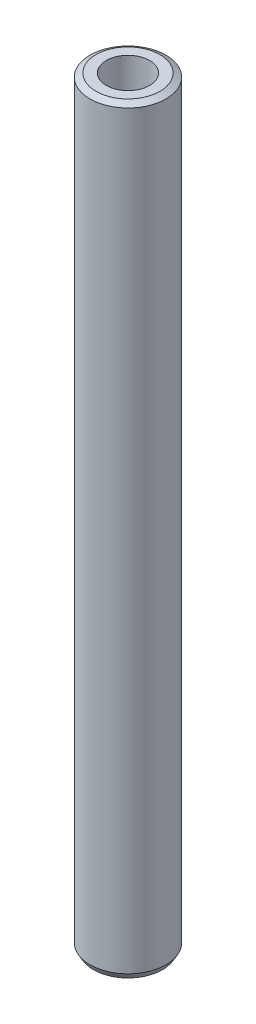
ISO-10303-21;
HEADER;
FILE_DESCRIPTION(('STEP AP214'),'2;1');
FILE_NAME('part.step','',(''),(''),'','','');
FILE_SCHEMA(('AUTOMOTIVE_DESIGN { 1 0 10303 214 1 1 1 1 }'));
ENDSEC;
DATA;
#1=APPLICATION_CONTEXT('core data for automotive mechanical design processes');
#2=APPLICATION_PROTOCOL_DEFINITION('international standard','automotive_design',2000,#1);
#3=PRODUCT_CONTEXT('',#1,'mechanical');
#4=PRODUCT('Part','Part','',(#3));
#5=PRODUCT_RELATED_PRODUCT_CATEGORY('part','',(#4));
#6=PRODUCT_DEFINITION_FORMATION('','',#4);
#7=PRODUCT_DEFINITION_CONTEXT('part definition',#1,'design');
#8=PRODUCT_DEFINITION('design','',#6,#7);
#9=PRODUCT_DEFINITION_SHAPE('','',#8);
#10=(LENGTH_UNIT() NAMED_UNIT(*) SI_UNIT(.MILLI.,.METRE.));
#11=(NAMED_UNIT(*) PLANE_ANGLE_UNIT() SI_UNIT($,.RADIAN.));
#12=(NAMED_UNIT(*) SI_UNIT($,.STERADIAN.) SOLID_ANGLE_UNIT());
#13=UNCERTAINTY_MEASURE_WITH_UNIT(LENGTH_MEASURE(1.E-05),#10,'distance_accuracy_value','');
#14=(GEOMETRIC_REPRESENTATION_CONTEXT(3) GLOBAL_UNCERTAINTY_ASSIGNED_CONTEXT((#13)) GLOBAL_UNIT_ASSIGNED_CONTEXT((#10,
#11,#12)) REPRESENTATION_CONTEXT('',''));
#15=CARTESIAN_POINT('',(0.,0.,0.));
#16=DIRECTION('',(0.,0.,1.));
#17=DIRECTION('',(1.,0.,0.));
#18=AXIS2_PLACEMENT_3D('',#15,#16,#17);
#19=CARTESIAN_POINT('',(0.,399.763591332747,0.));
#20=DIRECTION('',(0.,-1.,0.));
#21=DIRECTION('',(0.,0.,-1.));
#22=AXIS2_PLACEMENT_3D('',#19,#20,#21);
#23=CYLINDRICAL_SURFACE('',#22,20.);
#24=CARTESIAN_POINT('',(0.,397.913172267002,0.));
#25=DIRECTION('',(0.,1.,0.));
#26=DIRECTION('',(0.,0.,1.));
#27=AXIS2_PLACEMENT_3D('',#24,#25,#26);
#28=CIRCLE('',#27,20.);
#29=CARTESIAN_POINT('',(0.,397.913172267002,20.));
#30=VERTEX_POINT('',#29);
#31=EDGE_CURVE('E50',#30,#30,#28,.F.);
#32=ORIENTED_EDGE('',*,*,#31,.T.);
#33=EDGE_LOOP('',(#32));
#34=FACE_BOUND('',#33,.T.);
#35=CARTESIAN_POINT('',(0.,3.20501983716426,0.));
#36=DIRECTION('',(0.,1.,0.));
#37=DIRECTION('',(0.,0.,1.));
#38=AXIS2_PLACEMENT_3D('',#35,#36,#37);
#39=CIRCLE('',#38,20.);
#40=CARTESIAN_POINT('',(0.,3.20501983716426,20.));
#41=VERTEX_POINT('',#40);
#42=EDGE_CURVE('E51',#41,#41,#39,.T.);
#43=ORIENTED_EDGE('',*,*,#42,.T.);
#44=EDGE_LOOP('',(#43));
#45=FACE_BOUND('',#44,.T.);
#46=ADVANCED_FACE('F39',(#34,#45),#23,.T.);
#47=CARTESIAN_POINT('',(0.,399.763591332747,0.));
#48=DIRECTION('',(0.,1.,0.));
#49=DIRECTION('',(0.,0.,1.));
#50=AXIS2_PLACEMENT_3D('',#47,#48,#49);
#51=PLANE('',#50);
#52=CARTESIAN_POINT('',(0.,399.763591332747,0.));
#53=DIRECTION('',(0.,1.,0.));
#54=DIRECTION('',(0.,0.,1.));
#55=AXIS2_PLACEMENT_3D('',#52,#53,#54);
#56=CIRCLE('',#55,16.7949801628356);
#57=CARTESIAN_POINT('',(0.,399.763591332747,16.7949801628356));
#58=VERTEX_POINT('',#57);
#59=EDGE_CURVE('E54',#58,#58,#56,.T.);
#60=ORIENTED_EDGE('',*,*,#59,.T.);
#61=EDGE_LOOP('',(#60));
#62=FACE_BOUND('',#61,.T.);
#63=CARTESIAN_POINT('',(0.,399.763591332747,0.));
#64=DIRECTION('',(0.,1.,0.));
#65=DIRECTION('',(0.,0.,1.));
#66=AXIS2_PLACEMENT_3D('',#63,#64,#65);
#67=CIRCLE('',#66,11.4137695171545);
#68=CARTESIAN_POINT('',(0.,399.763591332747,11.4137695171545));
#69=VERTEX_POINT('',#68);
#70=EDGE_CURVE('E58',#69,#69,#67,.T.);
#71=ORIENTED_EDGE('',*,*,#70,.F.);
#72=EDGE_LOOP('',(#71));
#73=FACE_BOUND('',#72,.T.);
#74=ADVANCED_FACE('F69',(#62,#73),#51,.T.);
#75=CARTESIAN_POINT('',(0.,0.,0.));
#76=DIRECTION('',(0.,1.,0.));
#77=DIRECTION('',(0.,0.,1.));
#78=AXIS2_PLACEMENT_3D('',#75,#76,#77);
#79=PLANE('',#78);
#80=CARTESIAN_POINT('',(0.,0.,0.));
#81=DIRECTION('',(0.,1.,0.));
#82=DIRECTION('',(0.,0.,1.));
#83=AXIS2_PLACEMENT_3D('',#80,#81,#82);
#84=CIRCLE('',#83,18.1495809342551);
#85=CARTESIAN_POINT('',(0.,0.,18.1495809342551));
#86=VERTEX_POINT('',#85);
#87=EDGE_CURVE('E10',#86,#86,#84,.F.);
#88=ORIENTED_EDGE('',*,*,#87,.T.);
#89=EDGE_LOOP('',(#88));
#90=FACE_BOUND('',#89,.T.);
#91=CARTESIAN_POINT('',(0.,0.,0.));
#92=DIRECTION('',(0.,1.,0.));
#93=DIRECTION('',(0.,0.,1.));
#94=AXIS2_PLACEMENT_3D('',#91,#92,#93);
#95=CIRCLE('',#94,11.4137695171545);
#96=CARTESIAN_POINT('',(0.,0.,11.4137695171545));
#97=VERTEX_POINT('',#96);
#98=EDGE_CURVE('E63',#97,#97,#95,.T.);
#99=ORIENTED_EDGE('',*,*,#98,.T.);
#100=EDGE_LOOP('',(#99));
#101=FACE_BOUND('',#100,.T.);
#102=ADVANCED_FACE('F75',(#90,#101),#79,.F.);
#103=CARTESIAN_POINT('',(0.,399.763591332747,0.));
#104=DIRECTION('',(0.,-1.,0.));
#105=DIRECTION('',(0.,0.,-1.));
#106=AXIS2_PLACEMENT_3D('',#103,#104,#105);
#107=CYLINDRICAL_SURFACE('',#106,11.4137695171545);
#108=ORIENTED_EDGE('',*,*,#70,.T.);
#109=EDGE_LOOP('',(#108));
#110=FACE_BOUND('',#109,.T.);
#111=ORIENTED_EDGE('',*,*,#98,.F.);
#112=EDGE_LOOP('',(#111));
#113=FACE_BOUND('',#112,.T.);
#114=ADVANCED_FACE('F70',(#110,#113),#107,.F.);
#115=CARTESIAN_POINT('',(0.,399.763591332747,0.));
#116=DIRECTION('',(0.,-1.,0.));
#117=DIRECTION('',(0.,0.,-1.));
#118=AXIS2_PLACEMENT_3D('',#115,#116,#117);
#119=CONICAL_SURFACE('',#118,16.7949801628356,1.0471975511966);
#120=ORIENTED_EDGE('',*,*,#31,.F.);
#121=EDGE_LOOP('',(#120));
#122=FACE_BOUND('',#121,.T.);
#123=ORIENTED_EDGE('',*,*,#59,.F.);
#124=EDGE_LOOP('',(#123));
#125=FACE_BOUND('',#124,.T.);
#126=ADVANCED_FACE('F81',(#122,#125),#119,.T.);
#127=CARTESIAN_POINT('',(0.,3.20501983716426,0.));
#128=DIRECTION('',(0.,1.,0.));
#129=DIRECTION('',(0.,0.,1.));
#130=AXIS2_PLACEMENT_3D('',#127,#128,#129);
#131=CONICAL_SURFACE('',#130,20.,0.523598775598301);
#132=ORIENTED_EDGE('',*,*,#87,.F.);
#133=EDGE_LOOP('',(#132));
#134=FACE_BOUND('',#133,.T.);
#135=ORIENTED_EDGE('',*,*,#42,.F.);
#136=EDGE_LOOP('',(#135));
#137=FACE_BOUND('',#136,.T.);
#138=ADVANCED_FACE('F45',(#134,#137),#131,.T.);
#139=CLOSED_SHELL('',(#46,#74,#102,#114,#126,#138));
#140=MANIFOLD_SOLID_BREP('B2',#139);
#141=ADVANCED_BREP_SHAPE_REPRESENTATION('',(#18,#140),#14);
#142=SHAPE_DEFINITION_REPRESENTATION(#9,#141);
ENDSEC;
END-ISO-10303-21;
